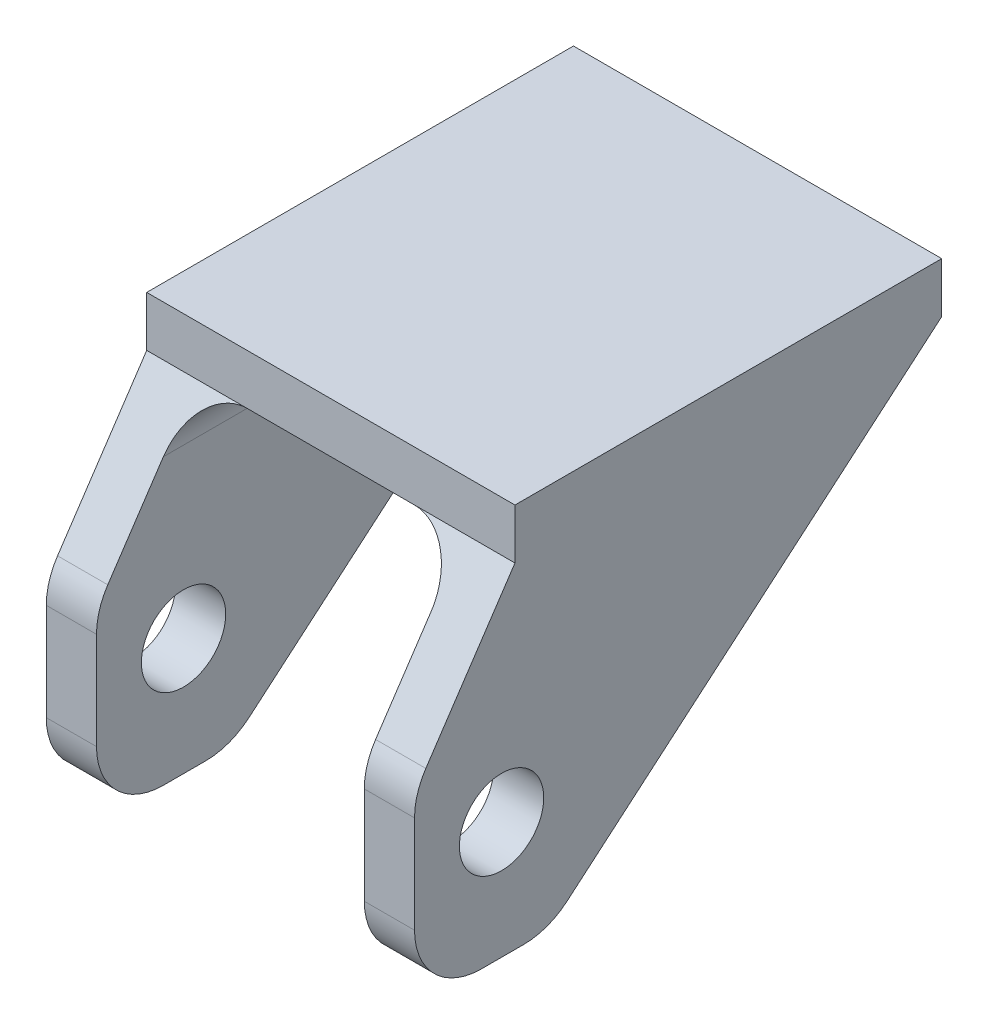
ISO-10303-21;
HEADER;
FILE_DESCRIPTION(('STEP AP214'),'2;1');
FILE_NAME('part.step','',(''),(''),'','','');
FILE_SCHEMA(('AUTOMOTIVE_DESIGN { 1 0 10303 214 1 1 1 1 }'));
ENDSEC;
DATA;
#1=APPLICATION_CONTEXT('core data for automotive mechanical design processes');
#2=APPLICATION_PROTOCOL_DEFINITION('international standard','automotive_design',2000,#1);
#3=PRODUCT_CONTEXT('',#1,'mechanical');
#4=PRODUCT('Part','Part','',(#3));
#5=PRODUCT_RELATED_PRODUCT_CATEGORY('part','',(#4));
#6=PRODUCT_DEFINITION_FORMATION('','',#4);
#7=PRODUCT_DEFINITION_CONTEXT('part definition',#1,'design');
#8=PRODUCT_DEFINITION('design','',#6,#7);
#9=PRODUCT_DEFINITION_SHAPE('','',#8);
#10=(LENGTH_UNIT() NAMED_UNIT(*) SI_UNIT(.MILLI.,.METRE.));
#11=(NAMED_UNIT(*) PLANE_ANGLE_UNIT() SI_UNIT($,.RADIAN.));
#12=(NAMED_UNIT(*) SI_UNIT($,.STERADIAN.) SOLID_ANGLE_UNIT());
#13=UNCERTAINTY_MEASURE_WITH_UNIT(LENGTH_MEASURE(1.E-05),#10,'distance_accuracy_value','');
#14=(GEOMETRIC_REPRESENTATION_CONTEXT(3) GLOBAL_UNCERTAINTY_ASSIGNED_CONTEXT((#13)) GLOBAL_UNIT_ASSIGNED_CONTEXT((#10,
#11,#12)) REPRESENTATION_CONTEXT('',''));
#15=CARTESIAN_POINT('',(0.,0.,0.));
#16=DIRECTION('',(0.,0.,1.));
#17=DIRECTION('',(1.,0.,0.));
#18=AXIS2_PLACEMENT_3D('',#15,#16,#17);
#19=CARTESIAN_POINT('',(0.,4.7625,25.));
#20=DIRECTION('',(0.,0.,1.));
#21=DIRECTION('',(1.,0.,0.));
#22=AXIS2_PLACEMENT_3D('',#19,#20,#21);
#23=PLANE('',#22);
#24=DIRECTION('',(0.,1.,0.));
#25=VECTOR('',#24,1.);
#26=CARTESIAN_POINT('',(-12.7,-31.75,25.));
#27=LINE('',#26,#25);
#28=CARTESIAN_POINT('',(-12.7,-25.4,25.));
#29=VERTEX_POINT('',#28);
#30=CARTESIAN_POINT('',(-12.7,-16.1746990921694,25.));
#31=VERTEX_POINT('',#30);
#32=EDGE_CURVE('E334',#29,#31,#27,.T.);
#33=ORIENTED_EDGE('',*,*,#32,.T.);
#34=DIRECTION('',(1.,0.,0.));
#35=VECTOR('',#34,1.);
#36=CARTESIAN_POINT('',(-17.4625,-16.1746990921694,25.));
#37=LINE('',#36,#35);
#38=CARTESIAN_POINT('',(-17.4625,-16.1746990921694,25.));
#39=VERTEX_POINT('',#38);
#40=EDGE_CURVE('E262',#31,#39,#37,.F.);
#41=ORIENTED_EDGE('',*,*,#40,.T.);
#42=DIRECTION('',(0.,-1.,0.));
#43=VECTOR('',#42,1.);
#44=CARTESIAN_POINT('',(-17.4625,4.7625,25.));
#45=LINE('',#44,#43);
#46=CARTESIAN_POINT('',(-17.4625,-25.4,25.));
#47=VERTEX_POINT('',#46);
#48=EDGE_CURVE('E203',#39,#47,#45,.T.);
#49=ORIENTED_EDGE('',*,*,#48,.T.);
#50=DIRECTION('',(-1.,0.,0.));
#51=VECTOR('',#50,1.);
#52=CARTESIAN_POINT('',(-12.7,-25.4,25.));
#53=LINE('',#52,#51);
#54=EDGE_CURVE('E260',#47,#29,#53,.F.);
#55=ORIENTED_EDGE('',*,*,#54,.T.);
#56=EDGE_LOOP('',(#33,#41,#49,#55));
#57=FACE_BOUND('',#56,.T.);
#58=ADVANCED_FACE('F38',(#57),#23,.T.);
#59=CARTESIAN_POINT('',(0.,0.,0.));
#60=DIRECTION('',(0.,1.,0.));
#61=DIRECTION('',(0.,0.,1.));
#62=AXIS2_PLACEMENT_3D('',#59,#60,#61);
#63=PLANE('',#62);
#64=DIRECTION('',(-1.,0.,0.));
#65=VECTOR('',#64,1.);
#66=CARTESIAN_POINT('',(0.,0.,-25.));
#67=LINE('',#66,#65);
#68=CARTESIAN_POINT('',(7.9375,0.,-25.));
#69=VERTEX_POINT('',#68);
#70=CARTESIAN_POINT('',(-7.9375,0.,-25.));
#71=VERTEX_POINT('',#70);
#72=EDGE_CURVE('E194',#69,#71,#67,.T.);
#73=ORIENTED_EDGE('',*,*,#72,.F.);
#74=DIRECTION('',(0.,0.,-1.));
#75=VECTOR('',#74,1.);
#76=CARTESIAN_POINT('',(7.9375,0.,15.475));
#77=LINE('',#76,#75);
#78=CARTESIAN_POINT('',(7.9375,0.,15.475));
#79=VERTEX_POINT('',#78);
#80=EDGE_CURVE('E278',#69,#79,#77,.F.);
#81=ORIENTED_EDGE('',*,*,#80,.T.);
#82=DIRECTION('',(1.,0.,0.));
#83=VECTOR('',#82,1.);
#84=CARTESIAN_POINT('',(-17.4625,0.,15.475));
#85=LINE('',#84,#83);
#86=CARTESIAN_POINT('',(-7.9375,0.,15.475));
#87=VERTEX_POINT('',#86);
#88=EDGE_CURVE('E693',#87,#79,#85,.T.);
#89=ORIENTED_EDGE('',*,*,#88,.F.);
#90=DIRECTION('',(0.,0.,-1.));
#91=VECTOR('',#90,1.);
#92=CARTESIAN_POINT('',(-7.9375,0.,0.));
#93=LINE('',#92,#91);
#94=EDGE_CURVE('E275',#87,#71,#93,.T.);
#95=ORIENTED_EDGE('',*,*,#94,.T.);
#96=EDGE_LOOP('',(#73,#81,#89,#95));
#97=FACE_BOUND('',#96,.T.);
#98=ADVANCED_FACE('F399',(#97),#63,.F.);
#99=CARTESIAN_POINT('',(0.,4.7625,-25.));
#100=DIRECTION('',(0.,0.,1.));
#101=DIRECTION('',(1.,0.,0.));
#102=AXIS2_PLACEMENT_3D('',#99,#100,#101);
#103=PLANE('',#102);
#104=DIRECTION('',(0.,-1.,0.));
#105=VECTOR('',#104,1.);
#106=CARTESIAN_POINT('',(17.4625,4.7625,-25.));
#107=LINE('',#106,#105);
#108=CARTESIAN_POINT('',(17.4625,4.7625,-25.));
#109=VERTEX_POINT('',#108);
#110=CARTESIAN_POINT('',(17.4625,0.,-25.));
#111=VERTEX_POINT('',#110);
#112=EDGE_CURVE('E343',#109,#111,#107,.T.);
#113=ORIENTED_EDGE('',*,*,#112,.T.);
#114=DIRECTION('',(1.,0.,0.));
#115=VECTOR('',#114,1.);
#116=CARTESIAN_POINT('',(-17.4625,0.,-25.));
#117=LINE('',#116,#115);
#118=EDGE_CURVE('E62',#69,#111,#117,.T.);
#119=ORIENTED_EDGE('',*,*,#118,.F.);
#120=ORIENTED_EDGE('',*,*,#72,.T.);
#121=CARTESIAN_POINT('',(-17.4625,0.,-25.));
#122=VERTEX_POINT('',#121);
#123=EDGE_CURVE('E78',#122,#71,#117,.T.);
#124=ORIENTED_EDGE('',*,*,#123,.F.);
#125=DIRECTION('',(0.,-1.,0.));
#126=VECTOR('',#125,1.);
#127=CARTESIAN_POINT('',(-17.4625,4.7625,-25.));
#128=LINE('',#127,#126);
#129=CARTESIAN_POINT('',(-17.4625,4.7625,-25.));
#130=VERTEX_POINT('',#129);
#131=EDGE_CURVE('E193',#130,#122,#128,.T.);
#132=ORIENTED_EDGE('',*,*,#131,.F.);
#133=DIRECTION('',(-1.,0.,0.));
#134=VECTOR('',#133,1.);
#135=CARTESIAN_POINT('',(0.,4.7625,-25.));
#136=LINE('',#135,#134);
#137=EDGE_CURVE('E337',#109,#130,#136,.T.);
#138=ORIENTED_EDGE('',*,*,#137,.F.);
#139=EDGE_LOOP('',(#113,#119,#120,#124,#132,#138));
#140=FACE_BOUND('',#139,.T.);
#141=ADVANCED_FACE('F191',(#140),#103,.F.);
#142=CARTESIAN_POINT('',(-17.4625,4.7625,0.));
#143=DIRECTION('',(1.,0.,0.));
#144=DIRECTION('',(0.,0.,-1.));
#145=AXIS2_PLACEMENT_3D('',#142,#143,#144);
#146=PLANE('',#145);
#147=CARTESIAN_POINT('',(-17.4625,-20.6375,16.745));
#148=DIRECTION('',(1.,0.,0.));
#149=DIRECTION('',(0.,0.,-1.));
#150=AXIS2_PLACEMENT_3D('',#147,#148,#149);
#151=CIRCLE('',#150,4.);
#152=CARTESIAN_POINT('',(-17.4625,-20.6375,12.745));
#153=VERTEX_POINT('',#152);
#154=EDGE_CURVE('E312',#153,#153,#151,.T.);
#155=ORIENTED_EDGE('',*,*,#154,.T.);
#156=EDGE_LOOP('',(#155));
#157=FACE_BOUND('',#156,.T.);
#158=DIRECTION('',(0.,-0.648181604007245,0.761485789904575));
#159=VECTOR('',#158,1.);
#160=CARTESIAN_POINT('',(-17.4625,-12.3395270182268,-10.5034847943351));
#161=LINE('',#160,#159);
#162=CARTESIAN_POINT('',(-17.4625,-30.2354347658941,10.5206839926881));
#163=VERTEX_POINT('',#162);
#164=EDGE_CURVE('E181',#122,#163,#161,.T.);
#165=ORIENTED_EDGE('',*,*,#164,.T.);
#166=CARTESIAN_POINT('',(-17.4625,-25.4,14.6366371781341));
#167=DIRECTION('',(1.,0.,0.));
#168=DIRECTION('',(0.,0.,-1.));
#169=AXIS2_PLACEMENT_3D('',#166,#167,#168);
#170=CIRCLE('',#169,6.35);
#171=CARTESIAN_POINT('',(-17.4625,-31.75,14.6366371781341));
#172=VERTEX_POINT('',#171);
#173=EDGE_CURVE('E235',#163,#172,#170,.F.);
#174=ORIENTED_EDGE('',*,*,#173,.T.);
#175=DIRECTION('',(0.,0.,1.));
#176=VECTOR('',#175,1.);
#177=CARTESIAN_POINT('',(-17.4625,-31.75,0.));
#178=LINE('',#177,#176);
#179=CARTESIAN_POINT('',(-17.4625,-31.75,18.65));
#180=VERTEX_POINT('',#179);
#181=EDGE_CURVE('E328',#172,#180,#178,.T.);
#182=ORIENTED_EDGE('',*,*,#181,.T.);
#183=CARTESIAN_POINT('',(-17.4625,-25.4,18.65));
#184=DIRECTION('',(1.,0.,0.));
#185=DIRECTION('',(0.,0.,-1.));
#186=AXIS2_PLACEMENT_3D('',#183,#184,#185);
#187=CIRCLE('',#186,6.35);
#188=EDGE_CURVE('E231',#180,#47,#187,.F.);
#189=ORIENTED_EDGE('',*,*,#188,.T.);
#190=ORIENTED_EDGE('',*,*,#48,.F.);
#191=CARTESIAN_POINT('',(-17.4625,-16.1746990921694,18.65));
#192=DIRECTION('',(1.,0.,0.));
#193=DIRECTION('',(0.,0.,-1.));
#194=AXIS2_PLACEMENT_3D('',#191,#192,#193);
#195=CIRCLE('',#194,6.35);
#196=CARTESIAN_POINT('',(-17.4625,-12.6455319689373,23.9289657525218));
#197=VERTEX_POINT('',#196);
#198=EDGE_CURVE('E233',#39,#197,#195,.F.);
#199=ORIENTED_EDGE('',*,*,#198,.T.);
#200=DIRECTION('',(0.,0.831333189373505,-0.555774350115293));
#201=VECTOR('',#200,1.);
#202=CARTESIAN_POINT('',(-17.4625,7.14997093575034,10.695002640392));
#203=LINE('',#202,#201);
#204=CARTESIAN_POINT('',(-17.4625,0.,15.475));
#205=VERTEX_POINT('',#204);
#206=EDGE_CURVE('E364',#197,#205,#203,.T.);
#207=ORIENTED_EDGE('',*,*,#206,.T.);
#208=DIRECTION('',(0.,1.,0.));
#209=VECTOR('',#208,1.);
#210=CARTESIAN_POINT('',(-17.4625,0.,15.475));
#211=LINE('',#210,#209);
#212=CARTESIAN_POINT('',(-17.4625,4.7625,15.475));
#213=VERTEX_POINT('',#212);
#214=EDGE_CURVE('E368',#205,#213,#211,.T.);
#215=ORIENTED_EDGE('',*,*,#214,.T.);
#216=DIRECTION('',(0.,0.,1.));
#217=VECTOR('',#216,1.);
#218=CARTESIAN_POINT('',(-17.4625,4.7625,0.));
#219=LINE('',#218,#217);
#220=EDGE_CURVE('E200',#130,#213,#219,.T.);
#221=ORIENTED_EDGE('',*,*,#220,.F.);
#222=ORIENTED_EDGE('',*,*,#131,.T.);
#223=EDGE_LOOP('',(#165,#174,#182,#189,#190,#199,#207,#215,#221,#222));
#224=FACE_BOUND('',#223,.T.);
#225=ADVANCED_FACE('F197',(#157,#224),#146,.F.);
#226=DIRECTION('',(0.,-1.,0.));
#227=VECTOR('',#226,1.);
#228=CARTESIAN_POINT('',(17.4625,4.7625,25.));
#229=LINE('',#228,#227);
#230=CARTESIAN_POINT('',(17.4625,-16.1746990921694,25.));
#231=VERTEX_POINT('',#230);
#232=CARTESIAN_POINT('',(17.4625,-25.4,25.));
#233=VERTEX_POINT('',#232);
#234=EDGE_CURVE('E209',#231,#233,#229,.T.);
#235=ORIENTED_EDGE('',*,*,#234,.F.);
#236=DIRECTION('',(1.,0.,0.));
#237=VECTOR('',#236,1.);
#238=CARTESIAN_POINT('',(12.7,-16.1746990921694,25.));
#239=LINE('',#238,#237);
#240=CARTESIAN_POINT('',(12.7,-16.1746990921694,25.));
#241=VERTEX_POINT('',#240);
#242=EDGE_CURVE('E270',#231,#241,#239,.F.);
#243=ORIENTED_EDGE('',*,*,#242,.T.);
#244=DIRECTION('',(0.,1.,0.));
#245=VECTOR('',#244,1.);
#246=CARTESIAN_POINT('',(12.7,-31.75,25.));
#247=LINE('',#246,#245);
#248=CARTESIAN_POINT('',(12.7,-25.4,25.));
#249=VERTEX_POINT('',#248);
#250=EDGE_CURVE('E326',#249,#241,#247,.T.);
#251=ORIENTED_EDGE('',*,*,#250,.F.);
#252=DIRECTION('',(1.,0.,0.));
#253=VECTOR('',#252,1.);
#254=CARTESIAN_POINT('',(17.4625,-25.4,25.));
#255=LINE('',#254,#253);
#256=EDGE_CURVE('E267',#249,#233,#255,.T.);
#257=ORIENTED_EDGE('',*,*,#256,.T.);
#258=EDGE_LOOP('',(#235,#243,#251,#257));
#259=FACE_BOUND('',#258,.T.);
#260=ADVANCED_FACE('F354',(#259),#23,.T.);
#261=CARTESIAN_POINT('',(17.4625,4.7625,0.));
#262=DIRECTION('',(1.,0.,0.));
#263=DIRECTION('',(0.,0.,-1.));
#264=AXIS2_PLACEMENT_3D('',#261,#262,#263);
#265=PLANE('',#264);
#266=DIRECTION('',(0.,0.,1.));
#267=VECTOR('',#266,1.);
#268=CARTESIAN_POINT('',(17.4625,-31.75,0.));
#269=LINE('',#268,#267);
#270=CARTESIAN_POINT('',(17.4625,-31.75,14.6366371781341));
#271=VERTEX_POINT('',#270);
#272=CARTESIAN_POINT('',(17.4625,-31.75,18.65));
#273=VERTEX_POINT('',#272);
#274=EDGE_CURVE('E320',#271,#273,#269,.T.);
#275=ORIENTED_EDGE('',*,*,#274,.F.);
#276=CARTESIAN_POINT('',(17.4625,-25.4,14.6366371781341));
#277=DIRECTION('',(1.,0.,0.));
#278=DIRECTION('',(0.,0.,-1.));
#279=AXIS2_PLACEMENT_3D('',#276,#277,#278);
#280=CIRCLE('',#279,6.35);
#281=CARTESIAN_POINT('',(17.4625,-30.2354347658941,10.5206839926881));
#282=VERTEX_POINT('',#281);
#283=EDGE_CURVE('E246',#271,#282,#280,.T.);
#284=ORIENTED_EDGE('',*,*,#283,.T.);
#285=DIRECTION('',(0.,-0.648181604007245,0.761485789904575));
#286=VECTOR('',#285,1.);
#287=CARTESIAN_POINT('',(17.4625,-12.3395270182268,-10.5034847943351));
#288=LINE('',#287,#286);
#289=EDGE_CURVE('E188',#111,#282,#288,.T.);
#290=ORIENTED_EDGE('',*,*,#289,.F.);
#291=ORIENTED_EDGE('',*,*,#112,.F.);
#292=DIRECTION('',(0.,0.,1.));
#293=VECTOR('',#292,1.);
#294=CARTESIAN_POINT('',(17.4625,4.7625,0.));
#295=LINE('',#294,#293);
#296=CARTESIAN_POINT('',(17.4625,4.7625,15.475));
#297=VERTEX_POINT('',#296);
#298=EDGE_CURVE('E340',#109,#297,#295,.T.);
#299=ORIENTED_EDGE('',*,*,#298,.T.);
#300=DIRECTION('',(0.,1.,0.));
#301=VECTOR('',#300,1.);
#302=CARTESIAN_POINT('',(17.4625,0.,15.475));
#303=LINE('',#302,#301);
#304=CARTESIAN_POINT('',(17.4625,0.,15.475));
#305=VERTEX_POINT('',#304);
#306=EDGE_CURVE('E361',#305,#297,#303,.T.);
#307=ORIENTED_EDGE('',*,*,#306,.F.);
#308=DIRECTION('',(0.,0.831333189373505,-0.555774350115293));
#309=VECTOR('',#308,1.);
#310=CARTESIAN_POINT('',(17.4625,7.14997093575034,10.695002640392));
#311=LINE('',#310,#309);
#312=CARTESIAN_POINT('',(17.4625,-12.6455319689373,23.9289657525218));
#313=VERTEX_POINT('',#312);
#314=EDGE_CURVE('E359',#313,#305,#311,.T.);
#315=ORIENTED_EDGE('',*,*,#314,.F.);
#316=CARTESIAN_POINT('',(17.4625,-16.1746990921694,18.65));
#317=DIRECTION('',(1.,0.,0.));
#318=DIRECTION('',(0.,0.,-1.));
#319=AXIS2_PLACEMENT_3D('',#316,#317,#318);
#320=CIRCLE('',#319,6.35);
#321=EDGE_CURVE('E244',#313,#231,#320,.T.);
#322=ORIENTED_EDGE('',*,*,#321,.T.);
#323=ORIENTED_EDGE('',*,*,#234,.T.);
#324=CARTESIAN_POINT('',(17.4625,-25.4,18.65));
#325=DIRECTION('',(1.,0.,0.));
#326=DIRECTION('',(0.,0.,-1.));
#327=AXIS2_PLACEMENT_3D('',#324,#325,#326);
#328=CIRCLE('',#327,6.35);
#329=EDGE_CURVE('E242',#233,#273,#328,.T.);
#330=ORIENTED_EDGE('',*,*,#329,.T.);
#331=EDGE_LOOP('',(#275,#284,#290,#291,#299,#307,#315,#322,#323,#330));
#332=FACE_BOUND('',#331,.T.);
#333=CARTESIAN_POINT('',(17.4625,-20.6375,16.745));
#334=DIRECTION('',(1.,0.,0.));
#335=DIRECTION('',(0.,0.,-1.));
#336=AXIS2_PLACEMENT_3D('',#333,#334,#335);
#337=CIRCLE('',#336,4.);
#338=CARTESIAN_POINT('',(17.4625,-20.6375,12.745));
#339=VERTEX_POINT('',#338);
#340=EDGE_CURVE('E370',#339,#339,#337,.T.);
#341=ORIENTED_EDGE('',*,*,#340,.F.);
#342=EDGE_LOOP('',(#341));
#343=FACE_BOUND('',#342,.T.);
#344=ADVANCED_FACE('F349',(#332,#343),#265,.T.);
#345=CARTESIAN_POINT('',(0.,4.7625,0.));
#346=DIRECTION('',(0.,1.,0.));
#347=DIRECTION('',(0.,0.,1.));
#348=AXIS2_PLACEMENT_3D('',#345,#346,#347);
#349=PLANE('',#348);
#350=DIRECTION('',(1.,0.,0.));
#351=VECTOR('',#350,1.);
#352=CARTESIAN_POINT('',(-17.4625,4.7625,15.475));
#353=LINE('',#352,#351);
#354=EDGE_CURVE('E372',#213,#297,#353,.T.);
#355=ORIENTED_EDGE('',*,*,#354,.T.);
#356=ORIENTED_EDGE('',*,*,#298,.F.);
#357=ORIENTED_EDGE('',*,*,#137,.T.);
#358=ORIENTED_EDGE('',*,*,#220,.T.);
#359=EDGE_LOOP('',(#355,#356,#357,#358));
#360=FACE_BOUND('',#359,.T.);
#361=ADVANCED_FACE('F414',(#360),#349,.T.);
#362=CARTESIAN_POINT('',(-12.7,-31.75,0.));
#363=DIRECTION('',(1.,0.,0.));
#364=DIRECTION('',(0.,0.,-1.));
#365=AXIS2_PLACEMENT_3D('',#362,#363,#364);
#366=PLANE('',#365);
#367=DIRECTION('',(0.,-0.648181604007245,0.761485789904575));
#368=VECTOR('',#367,1.);
#369=CARTESIAN_POINT('',(-12.7,-25.6789527070324,5.16771451881289));
#370=LINE('',#369,#368);
#371=CARTESIAN_POINT('',(-12.7,-4.76249999999999,-19.405));
#372=VERTEX_POINT('',#371);
#373=CARTESIAN_POINT('',(-12.7,-30.235434765894,10.5206839926881));
#374=VERTEX_POINT('',#373);
#375=EDGE_CURVE('E216',#372,#374,#370,.T.);
#376=ORIENTED_EDGE('',*,*,#375,.F.);
#377=DIRECTION('',(0.,0.,-1.));
#378=VECTOR('',#377,1.);
#379=CARTESIAN_POINT('',(-12.7,-4.7625,0.));
#380=LINE('',#379,#378);
#381=CARTESIAN_POINT('',(-12.7,-4.7625,18.6588923024579));
#382=VERTEX_POINT('',#381);
#383=EDGE_CURVE('E281',#372,#382,#380,.F.);
#384=ORIENTED_EDGE('',*,*,#383,.T.);
#385=DIRECTION('',(0.,0.831333189373505,-0.555774350115293));
#386=VECTOR('',#385,1.);
#387=CARTESIAN_POINT('',(-12.7,-14.7929262424368,25.3645714423353));
#388=LINE('',#387,#386);
#389=CARTESIAN_POINT('',(-12.7,-12.6455319689373,23.9289657525218));
#390=VERTEX_POINT('',#389);
#391=EDGE_CURVE('E317',#390,#382,#388,.T.);
#392=ORIENTED_EDGE('',*,*,#391,.F.);
#393=CARTESIAN_POINT('',(-12.7,-16.1746990921694,18.65));
#394=DIRECTION('',(1.,0.,0.));
#395=DIRECTION('',(0.,0.,-1.));
#396=AXIS2_PLACEMENT_3D('',#393,#394,#395);
#397=CIRCLE('',#396,6.35);
#398=EDGE_CURVE('E225',#390,#31,#397,.T.);
#399=ORIENTED_EDGE('',*,*,#398,.T.);
#400=ORIENTED_EDGE('',*,*,#32,.F.);
#401=CARTESIAN_POINT('',(-12.7,-25.4,18.65));
#402=DIRECTION('',(1.,0.,0.));
#403=DIRECTION('',(0.,0.,-1.));
#404=AXIS2_PLACEMENT_3D('',#401,#402,#403);
#405=CIRCLE('',#404,6.35);
#406=CARTESIAN_POINT('',(-12.7,-31.75,18.65));
#407=VERTEX_POINT('',#406);
#408=EDGE_CURVE('E223',#29,#407,#405,.T.);
#409=ORIENTED_EDGE('',*,*,#408,.T.);
#410=DIRECTION('',(0.,0.,-1.));
#411=VECTOR('',#410,1.);
#412=CARTESIAN_POINT('',(-12.7,-31.75,0.));
#413=LINE('',#412,#411);
#414=CARTESIAN_POINT('',(-12.7,-31.75,14.6366371781341));
#415=VERTEX_POINT('',#414);
#416=EDGE_CURVE('E331',#407,#415,#413,.T.);
#417=ORIENTED_EDGE('',*,*,#416,.T.);
#418=CARTESIAN_POINT('',(-12.7,-25.4,14.6366371781341));
#419=DIRECTION('',(1.,0.,0.));
#420=DIRECTION('',(0.,0.,-1.));
#421=AXIS2_PLACEMENT_3D('',#418,#419,#420);
#422=CIRCLE('',#421,6.35);
#423=EDGE_CURVE('E227',#415,#374,#422,.T.);
#424=ORIENTED_EDGE('',*,*,#423,.T.);
#425=EDGE_LOOP('',(#376,#384,#392,#399,#400,#409,#417,#424));
#426=FACE_BOUND('',#425,.T.);
#427=CARTESIAN_POINT('',(-12.7,-20.6375,16.745));
#428=DIRECTION('',(1.,0.,0.));
#429=DIRECTION('',(0.,0.,-1.));
#430=AXIS2_PLACEMENT_3D('',#427,#428,#429);
#431=CIRCLE('',#430,4.);
#432=CARTESIAN_POINT('',(-12.7,-20.6375,12.745));
#433=VERTEX_POINT('',#432);
#434=EDGE_CURVE('E215',#433,#433,#431,.T.);
#435=ORIENTED_EDGE('',*,*,#434,.F.);
#436=EDGE_LOOP('',(#435));
#437=FACE_BOUND('',#436,.T.);
#438=ADVANCED_FACE('F452',(#426,#437),#366,.T.);
#439=CARTESIAN_POINT('',(0.,-31.75,0.));
#440=DIRECTION('',(0.,1.,0.));
#441=DIRECTION('',(0.,0.,1.));
#442=AXIS2_PLACEMENT_3D('',#439,#440,#441);
#443=PLANE('',#442);
#444=ORIENTED_EDGE('',*,*,#181,.F.);
#445=DIRECTION('',(1.,0.,0.));
#446=VECTOR('',#445,1.);
#447=CARTESIAN_POINT('',(0.,-31.75,14.6366371781341));
#448=LINE('',#447,#446);
#449=EDGE_CURVE('E220',#172,#415,#448,.T.);
#450=ORIENTED_EDGE('',*,*,#449,.T.);
#451=ORIENTED_EDGE('',*,*,#416,.F.);
#452=DIRECTION('',(-1.,0.,0.));
#453=VECTOR('',#452,1.);
#454=CARTESIAN_POINT('',(-17.4625,-31.75,18.65));
#455=LINE('',#454,#453);
#456=EDGE_CURVE('E206',#407,#180,#455,.T.);
#457=ORIENTED_EDGE('',*,*,#456,.T.);
#458=EDGE_LOOP('',(#444,#450,#451,#457));
#459=FACE_BOUND('',#458,.T.);
#460=ADVANCED_FACE('F459',(#459),#443,.F.);
#461=CARTESIAN_POINT('',(12.7,-31.75,0.));
#462=DIRECTION('',(1.,0.,0.));
#463=DIRECTION('',(0.,0.,-1.));
#464=AXIS2_PLACEMENT_3D('',#461,#462,#463);
#465=PLANE('',#464);
#466=CARTESIAN_POINT('',(12.7,-20.6375,16.745));
#467=DIRECTION('',(1.,0.,0.));
#468=DIRECTION('',(0.,0.,-1.));
#469=AXIS2_PLACEMENT_3D('',#466,#467,#468);
#470=CIRCLE('',#469,4.);
#471=CARTESIAN_POINT('',(12.7,-20.6375,12.745));
#472=VERTEX_POINT('',#471);
#473=EDGE_CURVE('E213',#472,#472,#470,.T.);
#474=ORIENTED_EDGE('',*,*,#473,.T.);
#475=EDGE_LOOP('',(#474));
#476=FACE_BOUND('',#475,.T.);
#477=DIRECTION('',(0.,0.831333189373505,-0.555774350115293));
#478=VECTOR('',#477,1.);
#479=CARTESIAN_POINT('',(12.7,-14.7929262424368,25.3645714423353));
#480=LINE('',#479,#478);
#481=CARTESIAN_POINT('',(12.7,-12.6455319689373,23.9289657525218));
#482=VERTEX_POINT('',#481);
#483=CARTESIAN_POINT('',(12.7,-4.7625,18.6588923024579));
#484=VERTEX_POINT('',#483);
#485=EDGE_CURVE('E202',#482,#484,#480,.T.);
#486=ORIENTED_EDGE('',*,*,#485,.T.);
#487=DIRECTION('',(0.,0.,-1.));
#488=VECTOR('',#487,1.);
#489=CARTESIAN_POINT('',(12.7,-4.7625,-25.));
#490=LINE('',#489,#488);
#491=CARTESIAN_POINT('',(12.7,-4.76249999999999,-19.405));
#492=VERTEX_POINT('',#491);
#493=EDGE_CURVE('E272',#484,#492,#490,.T.);
#494=ORIENTED_EDGE('',*,*,#493,.T.);
#495=DIRECTION('',(0.,-0.648181604007245,0.761485789904575));
#496=VECTOR('',#495,1.);
#497=CARTESIAN_POINT('',(12.7,-25.6789527070324,5.16771451881289));
#498=LINE('',#497,#496);
#499=CARTESIAN_POINT('',(12.7,-30.235434765894,10.5206839926881));
#500=VERTEX_POINT('',#499);
#501=EDGE_CURVE('E195',#492,#500,#498,.T.);
#502=ORIENTED_EDGE('',*,*,#501,.T.);
#503=CARTESIAN_POINT('',(12.7,-25.4,14.6366371781341));
#504=DIRECTION('',(1.,0.,0.));
#505=DIRECTION('',(0.,0.,-1.));
#506=AXIS2_PLACEMENT_3D('',#503,#504,#505);
#507=CIRCLE('',#506,6.35);
#508=CARTESIAN_POINT('',(12.7,-31.75,14.6366371781341));
#509=VERTEX_POINT('',#508);
#510=EDGE_CURVE('E255',#500,#509,#507,.F.);
#511=ORIENTED_EDGE('',*,*,#510,.T.);
#512=DIRECTION('',(0.,0.,-1.));
#513=VECTOR('',#512,1.);
#514=CARTESIAN_POINT('',(12.7,-31.75,0.));
#515=LINE('',#514,#513);
#516=CARTESIAN_POINT('',(12.7,-31.75,18.65));
#517=VERTEX_POINT('',#516);
#518=EDGE_CURVE('E323',#517,#509,#515,.T.);
#519=ORIENTED_EDGE('',*,*,#518,.F.);
#520=CARTESIAN_POINT('',(12.7,-25.4,18.65));
#521=DIRECTION('',(1.,0.,0.));
#522=DIRECTION('',(0.,0.,-1.));
#523=AXIS2_PLACEMENT_3D('',#520,#521,#522);
#524=CIRCLE('',#523,6.35);
#525=EDGE_CURVE('E251',#517,#249,#524,.F.);
#526=ORIENTED_EDGE('',*,*,#525,.T.);
#527=ORIENTED_EDGE('',*,*,#250,.T.);
#528=CARTESIAN_POINT('',(12.7,-16.1746990921694,18.65));
#529=DIRECTION('',(1.,0.,0.));
#530=DIRECTION('',(0.,0.,-1.));
#531=AXIS2_PLACEMENT_3D('',#528,#529,#530);
#532=CIRCLE('',#531,6.35);
#533=EDGE_CURVE('E253',#241,#482,#532,.F.);
#534=ORIENTED_EDGE('',*,*,#533,.T.);
#535=EDGE_LOOP('',(#486,#494,#502,#511,#519,#526,#527,#534));
#536=FACE_BOUND('',#535,.T.);
#537=ADVANCED_FACE('F298',(#476,#536),#465,.F.);
#538=CARTESIAN_POINT('',(0.,-31.75,0.));
#539=DIRECTION('',(0.,1.,0.));
#540=DIRECTION('',(0.,0.,1.));
#541=AXIS2_PLACEMENT_3D('',#538,#539,#540);
#542=PLANE('',#541);
#543=ORIENTED_EDGE('',*,*,#518,.T.);
#544=DIRECTION('',(1.,0.,0.));
#545=VECTOR('',#544,1.);
#546=CARTESIAN_POINT('',(0.,-31.75,14.6366371781341));
#547=LINE('',#546,#545);
#548=EDGE_CURVE('E239',#509,#271,#547,.T.);
#549=ORIENTED_EDGE('',*,*,#548,.T.);
#550=ORIENTED_EDGE('',*,*,#274,.T.);
#551=DIRECTION('',(1.,0.,0.));
#552=VECTOR('',#551,1.);
#553=CARTESIAN_POINT('',(12.7,-31.75,18.65));
#554=LINE('',#553,#552);
#555=EDGE_CURVE('E237',#273,#517,#554,.F.);
#556=ORIENTED_EDGE('',*,*,#555,.T.);
#557=EDGE_LOOP('',(#543,#549,#550,#556));
#558=FACE_BOUND('',#557,.T.);
#559=ADVANCED_FACE('F472',(#558),#542,.F.);
#560=CARTESIAN_POINT('',(-17.4625,-12.3395270182268,-10.5034847943351));
#561=DIRECTION('',(0.,0.761485789904575,0.648181604007245));
#562=DIRECTION('',(0.,-0.648181604007245,0.761485789904575));
#563=AXIS2_PLACEMENT_3D('',#560,#561,#562);
#564=PLANE('',#563);
#565=ORIENTED_EDGE('',*,*,#289,.T.);
#566=DIRECTION('',(1.,0.,0.));
#567=VECTOR('',#566,1.);
#568=CARTESIAN_POINT('',(-17.4625,-30.2354347658941,10.5206839926881));
#569=LINE('',#568,#567);
#570=EDGE_CURVE('E248',#282,#500,#569,.F.);
#571=ORIENTED_EDGE('',*,*,#570,.T.);
#572=ORIENTED_EDGE('',*,*,#501,.F.);
#573=CARTESIAN_POINT('',(7.9375,-4.7625,-19.405));
#574=DIRECTION('',(0.,0.761485789904575,0.648181604007245));
#575=DIRECTION('',(0.,-0.648181604007245,0.761485789904575));
#576=AXIS2_PLACEMENT_3D('',#573,#574,#575);
#577=ELLIPSE('',#576,7.3474778836006,4.7625);
#578=EDGE_CURVE('E283',#492,#69,#577,.T.);
#579=ORIENTED_EDGE('',*,*,#578,.T.);
#580=ORIENTED_EDGE('',*,*,#118,.T.);
#581=EDGE_LOOP('',(#565,#571,#572,#579,#580));
#582=FACE_BOUND('',#581,.T.);
#583=ADVANCED_FACE('F305',(#582),#564,.F.);
#584=CARTESIAN_POINT('',(-17.4625,-20.6375,16.745));
#585=DIRECTION('',(1.,0.,0.));
#586=DIRECTION('',(0.,0.,-1.));
#587=AXIS2_PLACEMENT_3D('',#584,#585,#586);
#588=CYLINDRICAL_SURFACE('',#587,4.);
#589=ORIENTED_EDGE('',*,*,#340,.T.);
#590=EDGE_LOOP('',(#589));
#591=FACE_BOUND('',#590,.T.);
#592=ORIENTED_EDGE('',*,*,#473,.F.);
#593=EDGE_LOOP('',(#592));
#594=FACE_BOUND('',#593,.T.);
#595=ADVANCED_FACE('F385',(#591,#594),#588,.F.);
#596=CARTESIAN_POINT('',(-17.4625,7.14997093575034,10.695002640392));
#597=DIRECTION('',(0.,-0.555774350115293,-0.831333189373505));
#598=DIRECTION('',(0.,0.831333189373505,-0.555774350115293));
#599=AXIS2_PLACEMENT_3D('',#596,#597,#598);
#600=PLANE('',#599);
#601=ORIENTED_EDGE('',*,*,#485,.F.);
#602=DIRECTION('',(1.,0.,0.));
#603=VECTOR('',#602,1.);
#604=CARTESIAN_POINT('',(17.4625,-12.6455319689373,23.9289657525218));
#605=LINE('',#604,#603);
#606=EDGE_CURVE('E264',#482,#313,#605,.T.);
#607=ORIENTED_EDGE('',*,*,#606,.T.);
#608=ORIENTED_EDGE('',*,*,#314,.T.);
#609=EDGE_CURVE('E293',#79,#305,#85,.T.);
#610=ORIENTED_EDGE('',*,*,#609,.F.);
#611=CARTESIAN_POINT('',(7.9375,-4.7625,18.6588923024579));
#612=DIRECTION('',(0.,-0.555774350115293,-0.831333189373505));
#613=DIRECTION('',(0.,-0.831333189373505,0.555774350115293));
#614=AXIS2_PLACEMENT_3D('',#611,#612,#613);
#615=ELLIPSE('',#614,5.72874998962694,4.7625);
#616=EDGE_CURVE('E286',#79,#484,#615,.T.);
#617=ORIENTED_EDGE('',*,*,#616,.T.);
#618=EDGE_LOOP('',(#601,#607,#608,#610,#617));
#619=FACE_BOUND('',#618,.T.);
#620=ADVANCED_FACE('F290',(#619),#600,.F.);
#621=ORIENTED_EDGE('',*,*,#206,.F.);
#622=DIRECTION('',(1.,0.,0.));
#623=VECTOR('',#622,1.);
#624=CARTESIAN_POINT('',(-12.7,-12.6455319689373,23.9289657525218));
#625=LINE('',#624,#623);
#626=EDGE_CURVE('E257',#197,#390,#625,.T.);
#627=ORIENTED_EDGE('',*,*,#626,.T.);
#628=ORIENTED_EDGE('',*,*,#391,.T.);
#629=CARTESIAN_POINT('',(-7.9375,-4.7625,18.6588923024579));
#630=DIRECTION('',(0.,-0.555774350115293,-0.831333189373505));
#631=DIRECTION('',(0.,0.831333189373505,-0.555774350115293));
#632=AXIS2_PLACEMENT_3D('',#629,#630,#631);
#633=ELLIPSE('',#632,5.72874998962694,4.7625);
#634=EDGE_CURVE('E11',#382,#87,#633,.T.);
#635=ORIENTED_EDGE('',*,*,#634,.T.);
#636=EDGE_CURVE('E53',#205,#87,#85,.T.);
#637=ORIENTED_EDGE('',*,*,#636,.F.);
#638=EDGE_LOOP('',(#621,#627,#628,#635,#637));
#639=FACE_BOUND('',#638,.T.);
#640=ADVANCED_FACE('F448',(#639),#600,.F.);
#641=CARTESIAN_POINT('',(-17.4625,0.,15.475));
#642=DIRECTION('',(0.,0.,-1.));
#643=DIRECTION('',(-1.,0.,0.));
#644=AXIS2_PLACEMENT_3D('',#641,#642,#643);
#645=PLANE('',#644);
#646=ORIENTED_EDGE('',*,*,#306,.T.);
#647=ORIENTED_EDGE('',*,*,#354,.F.);
#648=ORIENTED_EDGE('',*,*,#214,.F.);
#649=ORIENTED_EDGE('',*,*,#636,.T.);
#650=ORIENTED_EDGE('',*,*,#88,.T.);
#651=ORIENTED_EDGE('',*,*,#609,.T.);
#652=EDGE_LOOP('',(#646,#647,#648,#649,#650,#651));
#653=FACE_BOUND('',#652,.T.);
#654=ADVANCED_FACE('F393',(#653),#645,.F.);
#655=ORIENTED_EDGE('',*,*,#123,.T.);
#656=CARTESIAN_POINT('',(-7.9375,-4.7625,-19.405));
#657=DIRECTION('',(0.,0.761485789904575,0.648181604007245));
#658=DIRECTION('',(0.,0.648181604007245,-0.761485789904575));
#659=AXIS2_PLACEMENT_3D('',#656,#657,#658);
#660=ELLIPSE('',#659,7.3474778836006,4.7625);
#661=EDGE_CURVE('E46',#71,#372,#660,.T.);
#662=ORIENTED_EDGE('',*,*,#661,.T.);
#663=ORIENTED_EDGE('',*,*,#375,.T.);
#664=DIRECTION('',(1.,0.,0.));
#665=VECTOR('',#664,1.);
#666=CARTESIAN_POINT('',(-17.4625,-30.2354347658941,10.5206839926881));
#667=LINE('',#666,#665);
#668=EDGE_CURVE('E184',#374,#163,#667,.F.);
#669=ORIENTED_EDGE('',*,*,#668,.T.);
#670=ORIENTED_EDGE('',*,*,#164,.F.);
#671=EDGE_LOOP('',(#655,#662,#663,#669,#670));
#672=FACE_BOUND('',#671,.T.);
#673=ADVANCED_FACE('F182',(#672),#564,.F.);
#674=ORIENTED_EDGE('',*,*,#434,.T.);
#675=EDGE_LOOP('',(#674));
#676=FACE_BOUND('',#675,.T.);
#677=ORIENTED_EDGE('',*,*,#154,.F.);
#678=EDGE_LOOP('',(#677));
#679=FACE_BOUND('',#678,.T.);
#680=ADVANCED_FACE('F380',(#676,#679),#588,.F.);
#681=CARTESIAN_POINT('',(0.,-25.4,14.6366371781341));
#682=DIRECTION('',(1.,0.,0.));
#683=DIRECTION('',(0.,0.,-1.));
#684=AXIS2_PLACEMENT_3D('',#681,#682,#683);
#685=CYLINDRICAL_SURFACE('',#684,6.35);
#686=ORIENTED_EDGE('',*,*,#173,.F.);
#687=ORIENTED_EDGE('',*,*,#668,.F.);
#688=ORIENTED_EDGE('',*,*,#423,.F.);
#689=ORIENTED_EDGE('',*,*,#449,.F.);
#690=EDGE_LOOP('',(#686,#687,#688,#689));
#691=FACE_BOUND('',#690,.T.);
#692=ADVANCED_FACE('F382',(#691),#685,.T.);
#693=CARTESIAN_POINT('',(0.,-25.4,14.6366371781341));
#694=DIRECTION('',(1.,0.,0.));
#695=DIRECTION('',(0.,0.,-1.));
#696=AXIS2_PLACEMENT_3D('',#693,#694,#695);
#697=CYLINDRICAL_SURFACE('',#696,6.35);
#698=ORIENTED_EDGE('',*,*,#510,.F.);
#699=ORIENTED_EDGE('',*,*,#570,.F.);
#700=ORIENTED_EDGE('',*,*,#283,.F.);
#701=ORIENTED_EDGE('',*,*,#548,.F.);
#702=EDGE_LOOP('',(#698,#699,#700,#701));
#703=FACE_BOUND('',#702,.T.);
#704=ADVANCED_FACE('F390',(#703),#697,.T.);
#705=CARTESIAN_POINT('',(-17.4625,-16.1746990921694,18.65));
#706=DIRECTION('',(-1.,0.,0.));
#707=DIRECTION('',(0.,-1.,0.));
#708=AXIS2_PLACEMENT_3D('',#705,#706,#707);
#709=CYLINDRICAL_SURFACE('',#708,6.35);
#710=ORIENTED_EDGE('',*,*,#198,.F.);
#711=ORIENTED_EDGE('',*,*,#40,.F.);
#712=ORIENTED_EDGE('',*,*,#398,.F.);
#713=ORIENTED_EDGE('',*,*,#626,.F.);
#714=EDGE_LOOP('',(#710,#711,#712,#713));
#715=FACE_BOUND('',#714,.T.);
#716=ADVANCED_FACE('F422',(#715),#709,.T.);
#717=CARTESIAN_POINT('',(-17.4625,-16.1746990921694,18.65));
#718=DIRECTION('',(-1.,0.,0.));
#719=DIRECTION('',(0.,-1.,0.));
#720=AXIS2_PLACEMENT_3D('',#717,#718,#719);
#721=CYLINDRICAL_SURFACE('',#720,6.35);
#722=ORIENTED_EDGE('',*,*,#533,.F.);
#723=ORIENTED_EDGE('',*,*,#242,.F.);
#724=ORIENTED_EDGE('',*,*,#321,.F.);
#725=ORIENTED_EDGE('',*,*,#606,.F.);
#726=EDGE_LOOP('',(#722,#723,#724,#725));
#727=FACE_BOUND('',#726,.T.);
#728=ADVANCED_FACE('F358',(#727),#721,.T.);
#729=CARTESIAN_POINT('',(0.,-25.4,18.65));
#730=DIRECTION('',(1.,0.,0.));
#731=DIRECTION('',(0.,0.,-1.));
#732=AXIS2_PLACEMENT_3D('',#729,#730,#731);
#733=CYLINDRICAL_SURFACE('',#732,6.35);
#734=ORIENTED_EDGE('',*,*,#408,.F.);
#735=ORIENTED_EDGE('',*,*,#54,.F.);
#736=ORIENTED_EDGE('',*,*,#188,.F.);
#737=ORIENTED_EDGE('',*,*,#456,.F.);
#738=EDGE_LOOP('',(#734,#735,#736,#737));
#739=FACE_BOUND('',#738,.T.);
#740=ADVANCED_FACE('F429',(#739),#733,.T.);
#741=CARTESIAN_POINT('',(0.,-25.4,18.65));
#742=DIRECTION('',(-1.,0.,0.));
#743=DIRECTION('',(0.,0.,1.));
#744=AXIS2_PLACEMENT_3D('',#741,#742,#743);
#745=CYLINDRICAL_SURFACE('',#744,6.35);
#746=ORIENTED_EDGE('',*,*,#525,.F.);
#747=ORIENTED_EDGE('',*,*,#555,.F.);
#748=ORIENTED_EDGE('',*,*,#329,.F.);
#749=ORIENTED_EDGE('',*,*,#256,.F.);
#750=EDGE_LOOP('',(#746,#747,#748,#749));
#751=FACE_BOUND('',#750,.T.);
#752=ADVANCED_FACE('F432',(#751),#745,.T.);
#753=CARTESIAN_POINT('',(7.9375,-4.7625,0.));
#754=DIRECTION('',(0.,0.,1.));
#755=DIRECTION('',(1.,0.,0.));
#756=AXIS2_PLACEMENT_3D('',#753,#754,#755);
#757=CYLINDRICAL_SURFACE('',#756,4.7625);
#758=ORIENTED_EDGE('',*,*,#616,.F.);
#759=ORIENTED_EDGE('',*,*,#80,.F.);
#760=ORIENTED_EDGE('',*,*,#578,.F.);
#761=ORIENTED_EDGE('',*,*,#493,.F.);
#762=EDGE_LOOP('',(#758,#759,#760,#761));
#763=FACE_BOUND('',#762,.T.);
#764=ADVANCED_FACE('F302',(#763),#757,.F.);
#765=CARTESIAN_POINT('',(-7.9375,-4.7625,0.));
#766=DIRECTION('',(0.,0.,-1.));
#767=DIRECTION('',(-1.,0.,0.));
#768=AXIS2_PLACEMENT_3D('',#765,#766,#767);
#769=CYLINDRICAL_SURFACE('',#768,4.7625);
#770=ORIENTED_EDGE('',*,*,#634,.F.);
#771=ORIENTED_EDGE('',*,*,#383,.F.);
#772=ORIENTED_EDGE('',*,*,#661,.F.);
#773=ORIENTED_EDGE('',*,*,#94,.F.);
#774=EDGE_LOOP('',(#770,#771,#772,#773));
#775=FACE_BOUND('',#774,.T.);
#776=ADVANCED_FACE('F40',(#775),#769,.F.);
#777=CLOSED_SHELL('',(#58,#98,#141,#225,#260,#344,#361,#438,#460,#537,#559,#583,#595,#620,#640,
#654,#673,#680,#692,#704,#716,#728,#740,#752,#764,#776));
#778=MANIFOLD_SOLID_BREP('B2',#777);
#779=ADVANCED_BREP_SHAPE_REPRESENTATION('',(#18,#778),#14);
#780=SHAPE_DEFINITION_REPRESENTATION(#9,#779);
ENDSEC;
END-ISO-10303-21;
